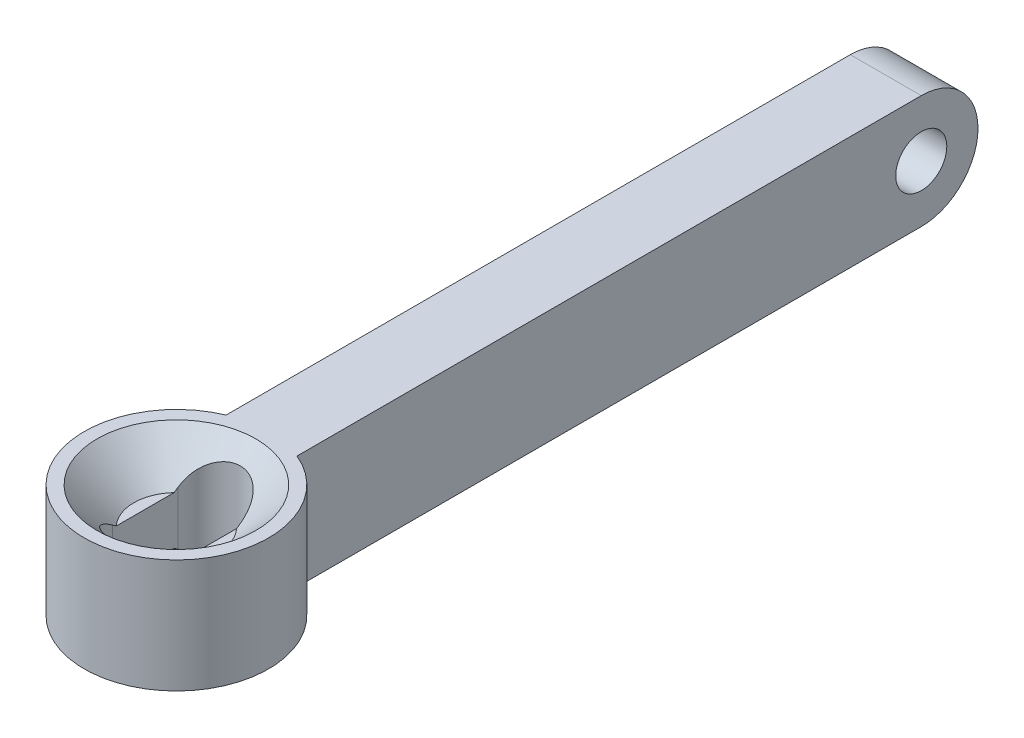
ISO-10303-21;
HEADER;
FILE_DESCRIPTION(('STEP AP214'),'2;1');
FILE_NAME('part.step','',(''),(''),'','','');
FILE_SCHEMA(('AUTOMOTIVE_DESIGN { 1 0 10303 214 1 1 1 1 }'));
ENDSEC;
DATA;
#1=APPLICATION_CONTEXT('core data for automotive mechanical design processes');
#2=APPLICATION_PROTOCOL_DEFINITION('international standard','automotive_design',2000,#1);
#3=PRODUCT_CONTEXT('',#1,'mechanical');
#4=PRODUCT('Part','Part','',(#3));
#5=PRODUCT_RELATED_PRODUCT_CATEGORY('part','',(#4));
#6=PRODUCT_DEFINITION_FORMATION('','',#4);
#7=PRODUCT_DEFINITION_CONTEXT('part definition',#1,'design');
#8=PRODUCT_DEFINITION('design','',#6,#7);
#9=PRODUCT_DEFINITION_SHAPE('','',#8);
#10=(LENGTH_UNIT() NAMED_UNIT(*) SI_UNIT(.MILLI.,.METRE.));
#11=(NAMED_UNIT(*) PLANE_ANGLE_UNIT() SI_UNIT($,.RADIAN.));
#12=(NAMED_UNIT(*) SI_UNIT($,.STERADIAN.) SOLID_ANGLE_UNIT());
#13=UNCERTAINTY_MEASURE_WITH_UNIT(LENGTH_MEASURE(1.E-05),#10,'distance_accuracy_value','');
#14=(GEOMETRIC_REPRESENTATION_CONTEXT(3) GLOBAL_UNCERTAINTY_ASSIGNED_CONTEXT((#13)) GLOBAL_UNIT_ASSIGNED_CONTEXT((#10,
#11,#12)) REPRESENTATION_CONTEXT('',''));
#15=CARTESIAN_POINT('',(0.,0.,0.));
#16=DIRECTION('',(0.,0.,1.));
#17=DIRECTION('',(1.,0.,0.));
#18=AXIS2_PLACEMENT_3D('',#15,#16,#17);
#19=CARTESIAN_POINT('',(0.,4.,0.));
#20=DIRECTION('',(0.,-1.,0.));
#21=DIRECTION('',(0.,0.,-1.));
#22=AXIS2_PLACEMENT_3D('',#19,#20,#21);
#23=CYLINDRICAL_SURFACE('',#22,3.25);
#24=DIRECTION('',(0.,-1.,0.));
#25=VECTOR('',#24,1.);
#26=CARTESIAN_POINT('',(1.25,4.,-3.));
#27=LINE('',#26,#25);
#28=CARTESIAN_POINT('',(1.25,4.,-3.));
#29=VERTEX_POINT('',#28);
#30=CARTESIAN_POINT('',(1.25,0.,-3.));
#31=VERTEX_POINT('',#30);
#32=EDGE_CURVE('E251',#29,#31,#27,.T.);
#33=ORIENTED_EDGE('',*,*,#32,.F.);
#34=CARTESIAN_POINT('',(0.,4.,0.));
#35=DIRECTION('',(0.,1.,0.));
#36=DIRECTION('',(0.,0.,1.));
#37=AXIS2_PLACEMENT_3D('',#34,#35,#36);
#38=CIRCLE('',#37,3.25);
#39=CARTESIAN_POINT('',(-1.25,4.,-3.));
#40=VERTEX_POINT('',#39);
#41=EDGE_CURVE('E216',#40,#29,#38,.T.);
#42=ORIENTED_EDGE('',*,*,#41,.F.);
#43=DIRECTION('',(0.,-1.,0.));
#44=VECTOR('',#43,1.);
#45=CARTESIAN_POINT('',(-1.25,4.,-3.));
#46=LINE('',#45,#44);
#47=CARTESIAN_POINT('',(-1.25,0.,-3.));
#48=VERTEX_POINT('',#47);
#49=EDGE_CURVE('E241',#40,#48,#46,.T.);
#50=ORIENTED_EDGE('',*,*,#49,.T.);
#51=CARTESIAN_POINT('',(0.,0.,0.));
#52=DIRECTION('',(0.,1.,0.));
#53=DIRECTION('',(0.,0.,1.));
#54=AXIS2_PLACEMENT_3D('',#51,#52,#53);
#55=CIRCLE('',#54,3.25);
#56=EDGE_CURVE('E217',#48,#31,#55,.T.);
#57=ORIENTED_EDGE('',*,*,#56,.T.);
#58=EDGE_LOOP('',(#33,#42,#50,#57));
#59=FACE_BOUND('',#58,.T.);
#60=ADVANCED_FACE('F34',(#59),#23,.T.);
#61=CARTESIAN_POINT('',(0.,4.,0.));
#62=DIRECTION('',(0.,1.,0.));
#63=DIRECTION('',(0.,0.,1.));
#64=AXIS2_PLACEMENT_3D('',#61,#62,#63);
#65=PLANE('',#64);
#66=CARTESIAN_POINT('',(0.,4.,0.));
#67=DIRECTION('',(0.,-1.,0.));
#68=DIRECTION('',(0.,0.,-1.));
#69=AXIS2_PLACEMENT_3D('',#66,#67,#68);
#70=CIRCLE('',#69,2.8);
#71=CARTESIAN_POINT('',(0.,4.,-2.8));
#72=VERTEX_POINT('',#71);
#73=EDGE_CURVE('E444',#72,#72,#70,.T.);
#74=ORIENTED_EDGE('',*,*,#73,.T.);
#75=EDGE_LOOP('',(#74));
#76=FACE_BOUND('',#75,.T.);
#77=DIRECTION('',(0.,0.,1.));
#78=VECTOR('',#77,1.);
#79=CARTESIAN_POINT('',(-1.25,4.,-3.));
#80=LINE('',#79,#78);
#81=CARTESIAN_POINT('',(-1.25,4.,-25.));
#82=VERTEX_POINT('',#81);
#83=EDGE_CURVE('E244',#82,#40,#80,.T.);
#84=ORIENTED_EDGE('',*,*,#83,.T.);
#85=ORIENTED_EDGE('',*,*,#41,.T.);
#86=DIRECTION('',(0.,0.,1.));
#87=VECTOR('',#86,1.);
#88=CARTESIAN_POINT('',(1.25,4.,-3.));
#89=LINE('',#88,#87);
#90=CARTESIAN_POINT('',(1.25,4.,-25.));
#91=VERTEX_POINT('',#90);
#92=EDGE_CURVE('E238',#91,#29,#89,.T.);
#93=ORIENTED_EDGE('',*,*,#92,.F.);
#94=DIRECTION('',(-1.,0.,0.));
#95=VECTOR('',#94,1.);
#96=CARTESIAN_POINT('',(1.25,4.,-25.));
#97=LINE('',#96,#95);
#98=EDGE_CURVE('E232',#91,#82,#97,.T.);
#99=ORIENTED_EDGE('',*,*,#98,.T.);
#100=EDGE_LOOP('',(#84,#85,#93,#99));
#101=FACE_BOUND('',#100,.T.);
#102=ADVANCED_FACE('F302',(#76,#101),#65,.T.);
#103=CARTESIAN_POINT('',(0.,0.,0.));
#104=DIRECTION('',(0.,1.,0.));
#105=DIRECTION('',(0.,0.,1.));
#106=AXIS2_PLACEMENT_3D('',#103,#104,#105);
#107=PLANE('',#106);
#108=CARTESIAN_POINT('',(0.,0.,0.));
#109=DIRECTION('',(0.,-1.,0.));
#110=DIRECTION('',(0.,0.,-1.));
#111=AXIS2_PLACEMENT_3D('',#108,#109,#110);
#112=CIRCLE('',#111,2.5);
#113=CARTESIAN_POINT('',(0.,0.,-2.5));
#114=VERTEX_POINT('',#113);
#115=EDGE_CURVE('E278',#114,#114,#112,.T.);
#116=ORIENTED_EDGE('',*,*,#115,.F.);
#117=EDGE_LOOP('',(#116));
#118=FACE_BOUND('',#117,.T.);
#119=DIRECTION('',(0.,0.,-1.));
#120=VECTOR('',#119,1.);
#121=CARTESIAN_POINT('',(1.25,0.,-3.));
#122=LINE('',#121,#120);
#123=CARTESIAN_POINT('',(1.25,0.,-25.));
#124=VERTEX_POINT('',#123);
#125=EDGE_CURVE('E249',#31,#124,#122,.T.);
#126=ORIENTED_EDGE('',*,*,#125,.F.);
#127=ORIENTED_EDGE('',*,*,#56,.F.);
#128=DIRECTION('',(0.,0.,-1.));
#129=VECTOR('',#128,1.);
#130=CARTESIAN_POINT('',(-1.25,0.,-3.));
#131=LINE('',#130,#129);
#132=CARTESIAN_POINT('',(-1.25,0.,-25.));
#133=VERTEX_POINT('',#132);
#134=EDGE_CURVE('E239',#48,#133,#131,.T.);
#135=ORIENTED_EDGE('',*,*,#134,.T.);
#136=DIRECTION('',(-1.,0.,0.));
#137=VECTOR('',#136,1.);
#138=CARTESIAN_POINT('',(1.25,0.,-25.));
#139=LINE('',#138,#137);
#140=EDGE_CURVE('E229',#124,#133,#139,.T.);
#141=ORIENTED_EDGE('',*,*,#140,.F.);
#142=EDGE_LOOP('',(#126,#127,#135,#141));
#143=FACE_BOUND('',#142,.T.);
#144=ADVANCED_FACE('F307',(#118,#143),#107,.F.);
#145=CARTESIAN_POINT('',(0.,4.,-1.15));
#146=DIRECTION('',(0.,-1.,0.));
#147=DIRECTION('',(0.,0.,-1.));
#148=AXIS2_PLACEMENT_3D('',#145,#146,#147);
#149=CYLINDRICAL_SURFACE('',#148,1.1);
#150=CARTESIAN_POINT('',(-1.09999998181818,2.79123851134895,-1.14980000000001));
#151=CARTESIAN_POINT('',(-1.10005734298542,2.83727686518787,-1.21346213388638));
#152=CARTESIAN_POINT('',(-1.09448993335906,2.88204477362716,-1.27821252134466));
#153=CARTESIAN_POINT('',(-1.07130834005445,2.96868210516723,-1.40820405365493));
#154=CARTESIAN_POINT('',(-1.05360205803646,3.01052665511345,-1.47344515228292));
#155=CARTESIAN_POINT('',(-1.00367490575828,3.09295101680243,-1.60606327114398));
#156=CARTESIAN_POINT('',(-0.970546108021612,3.13324972029756,-1.673282291868));
#157=CARTESIAN_POINT('',(-0.889508876860084,3.20809007706549,-1.80153496488029));
#158=CARTESIAN_POINT('',(-0.841647778345093,3.24264963048237,-1.86258760714681));
#159=CARTESIAN_POINT('',(-0.740110699274959,3.30028668920162,-1.96652128134119));
#160=CARTESIAN_POINT('',(-0.688356010463045,3.32430730431485,-2.01075445298934));
#161=CARTESIAN_POINT('',(-0.575934503958903,3.36661395309502,-2.08968146982421));
#162=CARTESIAN_POINT('',(-0.515273138862211,3.38490347397279,-2.12438111430593));
#163=CARTESIAN_POINT('',(-0.396137155446366,3.41291844441406,-2.17797393873818));
#164=CARTESIAN_POINT('',(-0.338546501516047,3.42348465582886,-2.1984003820654));
#165=CARTESIAN_POINT('',(-0.220120765175336,3.43950391962496,-2.22948375420956));
#166=CARTESIAN_POINT('',(-0.159288217137464,3.44496090595843,-2.24014819933491));
#167=CARTESIAN_POINT('',(-0.0417383354777392,3.45033568719122,-2.25065425236976));
#168=CARTESIAN_POINT('',(0.0148852006261075,3.45068788383433,-2.25134460670275));
#169=CARTESIAN_POINT('',(0.127416256892867,3.44695679591624,-2.24404836402719));
#170=CARTESIAN_POINT('',(0.183323900720304,3.44287428816399,-2.23606328665832));
#171=CARTESIAN_POINT('',(0.29163293172623,3.4305304207785,-2.21205620184121));
#172=CARTESIAN_POINT('',(0.344083494771923,3.42235937421503,-2.19620794781885));
#173=CARTESIAN_POINT('',(0.445402400925939,3.40211028162123,-2.15725547301861));
#174=CARTESIAN_POINT('',(0.494270397282102,3.39003185801154,-2.13415055101751));
#175=CARTESIAN_POINT('',(0.589104887257088,3.36173694857321,-2.08060847219464));
#176=CARTESIAN_POINT('',(0.634890781406755,3.34538076622122,-2.04992624201778));
#177=CARTESIAN_POINT('',(0.720552036873369,3.30916004239254,-1.98292538693596));
#178=CARTESIAN_POINT('',(0.760425785146596,3.28929454667819,-1.94660522931621));
#179=CARTESIAN_POINT('',(0.836850653829629,3.24460602083899,-1.86624925605483));
#180=CARTESIAN_POINT('',(0.872822157076153,3.21950372486615,-1.82181866745331));
#181=CARTESIAN_POINT('',(0.936795330850573,3.16611056825914,-1.72929465724043));
#182=CARTESIAN_POINT('',(0.964792802681917,3.13781803872301,-1.68119932280169));
#183=CARTESIAN_POINT('',(1.01568051999774,3.07490090925283,-1.57680349908624));
#184=CARTESIAN_POINT('',(1.03754067877926,3.0399244560096,-1.52021498739221));
#185=CARTESIAN_POINT('',(1.0714548956806,2.96709110176296,-1.40599397798228));
#186=CARTESIAN_POINT('',(1.08351012366882,2.92923454498664,-1.34836160565294));
#187=CARTESIAN_POINT('',(1.09398995312022,2.87408062130512,-1.26729771220161));
#188=CARTESIAN_POINT('',(1.09626200795652,2.8577530680499,-1.24364002220049));
#189=CARTESIAN_POINT('',(1.09926692301662,2.82475596380492,-1.19654813954689));
#190=CARTESIAN_POINT('',(1.10000337668831,2.8080873036355,-1.17311355314291));
#191=CARTESIAN_POINT('',(1.09999998181818,2.79123851134894,-1.14980000000001));
#192=B_SPLINE_CURVE_WITH_KNOTS('',3,(#150,#151,#152,#153,#154,#155,#156,#157,#158,#159,#160,
#161,#162,#163,#164,#165,#166,#167,#168,#169,#170,#171,#172,#173,#174,#175,#176,#177,#178,#179,
#180,#181,#182,#183,#184,#185,#186,#187,#188,#189,#190,#191),.UNSPECIFIED.,.F.,.F.,(4,2,2,2,2,2,
2,2,2,2,2,2,2,2,2,2,2,2,2,2,4),(0.,0.235683672119941,0.473175572121485,0.726872050090997,
0.979761762146121,1.19506785561738,1.41024268580156,1.59527637913252,1.78016748454459,
1.94922258541233,2.11824807836695,2.28369463658227,2.44915718707958,2.62090173501097,
2.79269305508027,2.97924095599862,3.16588690218748,3.37515157013405,3.58439126615019,
3.67086105287462,3.75712826421191),.UNSPECIFIED.);
#193=CARTESIAN_POINT('',(-1.1,2.79138304628395,-1.15));
#194=VERTEX_POINT('',#193);
#195=CARTESIAN_POINT('',(1.1,2.79138304628395,-1.15));
#196=VERTEX_POINT('',#195);
#197=EDGE_CURVE('E124',#194,#196,#192,.T.);
#198=ORIENTED_EDGE('',*,*,#197,.F.);
#199=DIRECTION('',(0.,-1.,0.));
#200=VECTOR('',#199,1.);
#201=CARTESIAN_POINT('',(-1.1,4.,-1.15));
#202=LINE('',#201,#200);
#203=CARTESIAN_POINT('',(-1.1,0.908616953716048,-1.15));
#204=VERTEX_POINT('',#203);
#205=EDGE_CURVE('E219',#194,#204,#202,.T.);
#206=ORIENTED_EDGE('',*,*,#205,.T.);
#207=CARTESIAN_POINT('',(1.09999998181818,0.908761488651053,-1.14980000000001));
#208=CARTESIAN_POINT('',(1.10005734298542,0.862723134812124,-1.21346213388638));
#209=CARTESIAN_POINT('',(1.09448993335906,0.817955226372842,-1.27821252134466));
#210=CARTESIAN_POINT('',(1.07130834005445,0.731317894832765,-1.40820405365493));
#211=CARTESIAN_POINT('',(1.05360205803646,0.689473344886545,-1.47344515228292));
#212=CARTESIAN_POINT('',(1.00367490575828,0.607048983197571,-1.60606327114398));
#213=CARTESIAN_POINT('',(0.970546108021611,0.566750279702436,-1.673282291868));
#214=CARTESIAN_POINT('',(0.889508876860083,0.491909922934511,-1.80153496488029));
#215=CARTESIAN_POINT('',(0.841647778345092,0.457350369517634,-1.86258760714681));
#216=CARTESIAN_POINT('',(0.740110699274958,0.399713310798384,-1.96652128134119));
#217=CARTESIAN_POINT('',(0.688356010463044,0.375692695685153,-2.01075445298934));
#218=CARTESIAN_POINT('',(0.575934503958903,0.333386046904978,-2.08968146982421));
#219=CARTESIAN_POINT('',(0.51527313886221,0.315096526027204,-2.12438111430593));
#220=CARTESIAN_POINT('',(0.396137155446365,0.287081555585936,-2.17797393873818));
#221=CARTESIAN_POINT('',(0.338546501516046,0.276515344171137,-2.1984003820654));
#222=CARTESIAN_POINT('',(0.220120765175335,0.260496080375044,-2.22948375420956));
#223=CARTESIAN_POINT('',(0.159288217137463,0.255039094041572,-2.24014819933491));
#224=CARTESIAN_POINT('',(0.0417383354777383,0.249664312808778,-2.25065425236976));
#225=CARTESIAN_POINT('',(-0.0148852006261084,0.249312116165667,-2.25134460670275));
#226=CARTESIAN_POINT('',(-0.127416256892868,0.253043204083761,-2.24404836402719));
#227=CARTESIAN_POINT('',(-0.183323900720305,0.257125711836014,-2.23606328665832));
#228=CARTESIAN_POINT('',(-0.291632931726231,0.269469579221497,-2.21205620184121));
#229=CARTESIAN_POINT('',(-0.344083494771925,0.277640625784969,-2.19620794781885));
#230=CARTESIAN_POINT('',(-0.44540240092594,0.297889718378769,-2.15725547301861));
#231=CARTESIAN_POINT('',(-0.494270397282103,0.309968141988461,-2.13415055101751));
#232=CARTESIAN_POINT('',(-0.589104887257089,0.338263051426792,-2.08060847219464));
#233=CARTESIAN_POINT('',(-0.634890781406757,0.354619233778779,-2.04992624201778));
#234=CARTESIAN_POINT('',(-0.72055203687337,0.390839957607457,-1.98292538693596));
#235=CARTESIAN_POINT('',(-0.760425785146597,0.410705453321812,-1.94660522931621));
#236=CARTESIAN_POINT('',(-0.83685065382963,0.455393979161011,-1.86624925605483));
#237=CARTESIAN_POINT('',(-0.872822157076154,0.48049627513385,-1.82181866745331));
#238=CARTESIAN_POINT('',(-0.936795330850574,0.533889431740863,-1.72929465724043));
#239=CARTESIAN_POINT('',(-0.964792802681918,0.562181961276985,-1.68119932280169));
#240=CARTESIAN_POINT('',(-1.01568051999774,0.625099090747166,-1.57680349908624));
#241=CARTESIAN_POINT('',(-1.03754067877926,0.660075543990395,-1.52021498739221));
#242=CARTESIAN_POINT('',(-1.0714548956806,0.732908898237041,-1.40599397798228));
#243=CARTESIAN_POINT('',(-1.08351012366882,0.770765455013362,-1.34836160565294));
#244=CARTESIAN_POINT('',(-1.09398995312022,0.825919378694878,-1.26729771220161));
#245=CARTESIAN_POINT('',(-1.09626200795652,0.842246931950097,-1.24364002220049));
#246=CARTESIAN_POINT('',(-1.09926692301662,0.875244036195079,-1.19654813954689));
#247=CARTESIAN_POINT('',(-1.10000337668832,0.891912696364494,-1.17311355314291));
#248=CARTESIAN_POINT('',(-1.09999998181818,0.908761488651052,-1.14980000000001));
#249=B_SPLINE_CURVE_WITH_KNOTS('',3,(#207,#208,#209,#210,#211,#212,#213,#214,#215,#216,#217,
#218,#219,#220,#221,#222,#223,#224,#225,#226,#227,#228,#229,#230,#231,#232,#233,#234,#235,#236,
#237,#238,#239,#240,#241,#242,#243,#244,#245,#246,#247,#248),.UNSPECIFIED.,.F.,.F.,(4,2,2,2,2,2,
2,2,2,2,2,2,2,2,2,2,2,2,2,2,4),(0.,0.235683672119941,0.473175572121484,0.726872050090997,
0.979761762146121,1.19506785561738,1.41024268580156,1.59527637913252,1.78016748454459,
1.94922258541233,2.11824807836695,2.28369463658227,2.44915718707958,2.62090173501097,
2.79269305508027,2.97924095599862,3.16588690218748,3.37515157013405,3.58439126615019,
3.67086105287462,3.75712826421191),.UNSPECIFIED.);
#250=CARTESIAN_POINT('',(1.1,0.908616953716048,-1.15));
#251=VERTEX_POINT('',#250);
#252=EDGE_CURVE('E192',#251,#204,#249,.T.);
#253=ORIENTED_EDGE('',*,*,#252,.F.);
#254=DIRECTION('',(0.,-1.,0.));
#255=VECTOR('',#254,1.);
#256=CARTESIAN_POINT('',(1.1,4.,-1.15));
#257=LINE('',#256,#255);
#258=EDGE_CURVE('E227',#196,#251,#257,.T.);
#259=ORIENTED_EDGE('',*,*,#258,.F.);
#260=EDGE_LOOP('',(#198,#206,#253,#259));
#261=FACE_BOUND('',#260,.T.);
#262=ADVANCED_FACE('F178',(#261),#149,.F.);
#263=CARTESIAN_POINT('',(-1.1,4.,-1.15));
#264=DIRECTION('',(1.,0.,0.));
#265=DIRECTION('',(0.,0.,-1.));
#266=AXIS2_PLACEMENT_3D('',#263,#264,#265);
#267=PLANE('',#266);
#268=CARTESIAN_POINT('',(-1.1,4.14827259274155,2.73538137763475));
#269=CARTESIAN_POINT('',(-1.1,4.0716987304082,2.65282369469881));
#270=CARTESIAN_POINT('',(-1.1,3.99535977476475,2.5700448233446));
#271=CARTESIAN_POINT('',(-1.1,3.84334978378572,2.40384316217279));
#272=CARTESIAN_POINT('',(-1.1,3.76767889901213,2.32042023476484));
#273=CARTESIAN_POINT('',(-1.1,3.61678103652053,2.15225690798743));
#274=CARTESIAN_POINT('',(-1.1,3.54155953043516,2.06751158773226));
#275=CARTESIAN_POINT('',(-1.1,3.39239154362782,1.89691931020546));
#276=CARTESIAN_POINT('',(-1.1,3.31844491240478,1.81107248508437));
#277=CARTESIAN_POINT('',(-1.1,3.1871389079424,1.65532461313932));
#278=CARTESIAN_POINT('',(-1.1,3.12944620377817,1.5857053803039));
#279=CARTESIAN_POINT('',(-1.1,3.01569361249054,1.44514800524554));
#280=CARTESIAN_POINT('',(-1.1,2.95963358736898,1.37420997532588));
#281=CARTESIAN_POINT('',(-1.1,2.84992003564901,1.23060400994485));
#282=CARTESIAN_POINT('',(-1.1,2.79626400217884,1.15793800349139));
#283=CARTESIAN_POINT('',(-1.1,2.69250847407567,1.01012920021532));
#284=CARTESIAN_POINT('',(-1.1,2.64240709887987,0.934987744290187));
#285=CARTESIAN_POINT('',(-1.1,2.54974723205385,0.784352546512437));
#286=CARTESIAN_POINT('',(-1.1,2.50696358774933,0.708999779199787));
#287=CARTESIAN_POINT('',(-1.1,2.42979640166252,0.553993196476297));
#288=CARTESIAN_POINT('',(-1.1,2.39540484009626,0.474343576905856));
#289=CARTESIAN_POINT('',(-1.1,2.34631529340789,0.328122846870461));
#290=CARTESIAN_POINT('',(-1.1,2.32895960189949,0.262480978435702));
#291=CARTESIAN_POINT('',(-1.1,2.3056573896797,0.129326903004181));
#292=CARTESIAN_POINT('',(-1.1,2.29966847827101,0.0618226015347261));
#293=CARTESIAN_POINT('',(-1.1,2.3003615743904,-0.0733239161148111));
#294=CARTESIAN_POINT('',(-1.1,2.30708259699507,-0.140965918188226));
#295=CARTESIAN_POINT('',(-1.1,2.33176246673506,-0.274278017831258));
#296=CARTESIAN_POINT('',(-1.1,2.34976068617452,-0.339940358398206));
#297=CARTESIAN_POINT('',(-1.1,2.39627158706687,-0.47486603830691));
#298=CARTESIAN_POINT('',(-1.1,2.42567166456206,-0.543810407083914));
#299=CARTESIAN_POINT('',(-1.1,2.49109851461019,-0.678536579882258));
#300=CARTESIAN_POINT('',(-1.1,2.5271385586755,-0.744311711266245));
#301=CARTESIAN_POINT('',(-1.1,2.604016532965,-0.874085164357024));
#302=CARTESIAN_POINT('',(-1.1,2.64490976893951,-0.93805014677361));
#303=CARTESIAN_POINT('',(-1.1,2.72961936441767,-1.06390479271224));
#304=CARTESIAN_POINT('',(-1.1,2.77343304691761,-1.12579628075644));
#305=CARTESIAN_POINT('',(-1.1,2.87011740401327,-1.25761766883687));
#306=CARTESIAN_POINT('',(-1.1,2.92333354196093,-1.32729249522001));
#307=CARTESIAN_POINT('',(-1.1,3.03164352795977,-1.46517271832197));
#308=CARTESIAN_POINT('',(-1.1,3.08673765488841,-1.53337789432473));
#309=CARTESIAN_POINT('',(-1.1,3.1983127194843,-1.66874896303959));
#310=CARTESIAN_POINT('',(-1.1,3.25479492126593,-1.73591381018886));
#311=CARTESIAN_POINT('',(-1.1,3.36874654476271,-1.86940205880185));
#312=CARTESIAN_POINT('',(-1.1,3.42621600043218,-1.93572543118804));
#313=CARTESIAN_POINT('',(-1.1,3.59288031969022,-2.12590767788013));
#314=CARTESIAN_POINT('',(-1.1,3.70301217818334,-2.24894473281726));
#315=CARTESIAN_POINT('',(-1.1,3.86931674473727,-2.43226093130263));
#316=CARTESIAN_POINT('',(-1.1,3.92487890388959,-2.49309842372966));
#317=CARTESIAN_POINT('',(-1.1,4.0363394755683,-2.61445968797421));
#318=CARTESIAN_POINT('',(-1.1,4.09223787292103,-2.67498347372249));
#319=CARTESIAN_POINT('',(-1.1,4.14827259274155,-2.73538137763475));
#320=B_SPLINE_CURVE_WITH_KNOTS('',3,(#268,#269,#270,#271,#272,#273,#274,#275,#276,#277,#278,
#279,#280,#281,#282,#283,#284,#285,#286,#287,#288,#289,#290,#291,#292,#293,#294,#295,#296,#297,
#298,#299,#300,#301,#302,#303,#304,#305,#306,#307,#308,#309,#310,#311,#312,#313,#314,#315,#316,
#317,#318,#319),.UNSPECIFIED.,.F.,.F.,(4,2,2,2,2,2,2,2,2,2,2,2,2,2,2,2,2,2,2,2,2,2,2,2,2,4),(0.,
0.337810797559631,0.675695877233268,1.0156291979445,1.35552211032705,1.62675724666943,
1.89796939060593,2.16889179994546,2.43966979442631,2.69933683128394,2.95875474028496,
3.1616784491808,3.36384388612662,3.5666309081644,3.77012990008906,3.99445050763644,
4.21922443419806,4.44686373353916,4.67429716481536,4.93726813354558,5.20027832451162,
5.4635376299139,5.72680600770931,6.22216009546388,6.46933408492065,6.71649700244117),.UNSPECIFIED.);
#321=CARTESIAN_POINT('',(-1.1,2.79138304628395,1.15));
#322=VERTEX_POINT('',#321);
#323=CARTESIAN_POINT('',(-1.1,2.69999999999999,1.01980390271856));
#324=VERTEX_POINT('',#323);
#325=EDGE_CURVE('E163',#322,#324,#320,.T.);
#326=ORIENTED_EDGE('',*,*,#325,.F.);
#327=DIRECTION('',(0.,-1.,0.));
#328=VECTOR('',#327,1.);
#329=CARTESIAN_POINT('',(-1.1,4.,1.15));
#330=LINE('',#329,#328);
#331=CARTESIAN_POINT('',(-1.1,0.908616953716048,1.15));
#332=VERTEX_POINT('',#331);
#333=EDGE_CURVE('E223',#322,#332,#330,.T.);
#334=ORIENTED_EDGE('',*,*,#333,.T.);
#335=CARTESIAN_POINT('',(-1.1,-0.373844872159509,-2.65499234447813));
#336=CARTESIAN_POINT('',(-1.1,-0.300573328970005,-2.57565766040961));
#337=CARTESIAN_POINT('',(-1.1,-0.227537729928543,-2.49610172244244));
#338=CARTESIAN_POINT('',(-1.1,-0.0821329576414764,-2.33635136463747));
#339=CARTESIAN_POINT('',(-1.1,-0.00976393600205381,-2.25615680692561));
#340=CARTESIAN_POINT('',(-1.1,0.13450740686511,-2.09448983484837));
#341=CARTESIAN_POINT('',(-1.1,0.206404406554211,-2.01301266057347));
#342=CARTESIAN_POINT('',(-1.1,0.348939845872555,-1.84897707488303));
#343=CARTESIAN_POINT('',(-1.1,0.419578432116305,-1.76641879139524));
#344=CARTESIAN_POINT('',(-1.1,0.545465050938376,-1.61602921513477));
#345=CARTESIAN_POINT('',(-1.1,0.601029511115495,-1.54846356699799));
#346=CARTESIAN_POINT('',(-1.1,0.710536986478492,-1.41203330057014));
#347=CARTESIAN_POINT('',(-1.1,0.76448014009484,-1.34316879400006));
#348=CARTESIAN_POINT('',(-1.1,0.869998698974348,-1.20373769746665));
#349=CARTESIAN_POINT('',(-1.1,0.92157628202369,-1.13317276812201));
#350=CARTESIAN_POINT('',(-1.1,1.02124486919323,-0.989641991736107));
#351=CARTESIAN_POINT('',(-1.1,1.06933767610185,-0.916677414929784));
#352=CARTESIAN_POINT('',(-1.1,1.15942122062728,-0.768486587432576));
#353=CARTESIAN_POINT('',(-1.1,1.20149174944419,-0.693309805685725));
#354=CARTESIAN_POINT('',(-1.1,1.2770442724807,-0.53867257851937));
#355=CARTESIAN_POINT('',(-1.1,1.31053658764174,-0.459217421353261));
#356=CARTESIAN_POINT('',(-1.1,1.35779063513898,-0.313448626472203));
#357=CARTESIAN_POINT('',(-1.1,1.3742659387683,-0.248063041465158));
#358=CARTESIAN_POINT('',(-1.1,1.39047715116036,-0.148709901120175));
#359=CARTESIAN_POINT('',(-1.1,1.39446423506883,-0.115422173749251));
#360=CARTESIAN_POINT('',(-1.1,1.39942857228191,-0.0486172904437803));
#361=CARTESIAN_POINT('',(-1.1,1.40040597620982,-0.0151001460748427));
#362=CARTESIAN_POINT('',(-1.1,1.39928547431632,0.051947377937465));
#363=CARTESIAN_POINT('',(-1.1,1.39718155245439,0.0854776553495899));
#364=CARTESIAN_POINT('',(-1.1,1.39001405495729,0.152226535655582));
#365=CARTESIAN_POINT('',(-1.1,1.38494918609994,0.185444995915014));
#366=CARTESIAN_POINT('',(-1.1,1.36565620886189,0.284467093540317));
#367=CARTESIAN_POINT('',(-1.1,1.34733421106003,0.349483448976039));
#368=CARTESIAN_POINT('',(-1.1,1.2996082086209,0.485356986017132));
#369=CARTESIAN_POINT('',(-1.1,1.26902076740353,0.555775889584228));
#370=CARTESIAN_POINT('',(-1.1,1.20109421172964,0.693351088862152));
#371=CARTESIAN_POINT('',(-1.1,1.16374102309195,0.760500206129757));
#372=CARTESIAN_POINT('',(-1.1,1.08418914523189,0.89294731259127));
#373=CARTESIAN_POINT('',(-1.1,1.04193624594087,0.958212140117718));
#374=CARTESIAN_POINT('',(-1.1,0.954500005340444,1.08663387072946));
#375=CARTESIAN_POINT('',(-1.1,0.90931944815215,1.1497926924313));
#376=CARTESIAN_POINT('',(-1.1,0.814696379614488,1.27756724583477));
#377=CARTESIAN_POINT('',(-1.1,0.765153380727519,1.3421080403628));
#378=CARTESIAN_POINT('',(-1.1,0.664470033078062,1.46993551665646));
#379=CARTESIAN_POINT('',(-1.1,0.613329508899633,1.53322205944335));
#380=CARTESIAN_POINT('',(-1.1,0.458107404478042,1.7217644915201));
#381=CARTESIAN_POINT('',(-1.1,0.352304618541031,1.84559932756755));
#382=CARTESIAN_POINT('',(-1.1,0.143762272209414,2.08446811318322));
#383=CARTESIAN_POINT('',(-1.1,0.0411571840749041,2.19962085748231));
#384=CARTESIAN_POINT('',(-1.1,-0.113815440051808,2.37120807945889));
#385=CARTESIAN_POINT('',(-1.1,-0.165605484824623,2.4281650113468));
#386=CARTESIAN_POINT('',(-1.1,-0.269502787228315,2.54178488071994));
#387=CARTESIAN_POINT('',(-1.1,-0.321610032518706,2.59844782948554));
#388=CARTESIAN_POINT('',(-1.1,-0.373844872159509,2.65499234447813));
#389=B_SPLINE_CURVE_WITH_KNOTS('',3,(#335,#336,#337,#338,#339,#340,#341,#342,#343,#344,#345,
#346,#347,#348,#349,#350,#351,#352,#353,#354,#355,#356,#357,#358,#359,#360,#361,#362,#363,#364,
#365,#366,#367,#368,#369,#370,#371,#372,#373,#374,#375,#376,#377,#378,#379,#380,#381,#382,#383,
#384,#385,#386,#387,#388),.UNSPECIFIED.,.F.,.F.,(4,2,2,2,2,2,2,2,2,2,2,2,2,2,2,2,2,2,2,2,2,2,2,
2,2,2,4),(0.,0.323985355452405,0.648042663547214,0.974023869885408,1.29996684527955,
1.56238586269114,1.82478241021019,2.08693233196262,2.34894565214134,2.60708034501468,
2.86490298659915,3.06631849923227,3.16677516515582,3.26722680351506,3.36787482725126,
3.46856684285998,3.67040691664665,3.90020304280569,4.13048280108013,4.36361035044209,
4.59651936632209,4.84057513247189,5.08465779197289,5.57321488220966,6.03590104328108,
6.26684724144117,6.49778451148571),.UNSPECIFIED.);
#390=CARTESIAN_POINT('',(-1.1,1.,1.01980390271856));
#391=VERTEX_POINT('',#390);
#392=EDGE_CURVE('E193',#391,#332,#389,.T.);
#393=ORIENTED_EDGE('',*,*,#392,.F.);
#394=DIRECTION('',(0.,0.,1.));
#395=VECTOR('',#394,1.);
#396=CARTESIAN_POINT('',(-1.1,1.,-1.15));
#397=LINE('',#396,#395);
#398=CARTESIAN_POINT('',(-1.1,1.,-1.01980390271856));
#399=VERTEX_POINT('',#398);
#400=EDGE_CURVE('E259',#399,#391,#397,.T.);
#401=ORIENTED_EDGE('',*,*,#400,.F.);
#402=EDGE_CURVE('E185',#204,#399,#389,.T.);
#403=ORIENTED_EDGE('',*,*,#402,.F.);
#404=ORIENTED_EDGE('',*,*,#205,.F.);
#405=CARTESIAN_POINT('',(-1.1,2.69999999999999,-1.01980390271856));
#406=VERTEX_POINT('',#405);
#407=EDGE_CURVE('E168',#406,#194,#320,.T.);
#408=ORIENTED_EDGE('',*,*,#407,.F.);
#409=DIRECTION('',(0.,0.,-1.));
#410=VECTOR('',#409,1.);
#411=CARTESIAN_POINT('',(-1.1,2.69999999999999,-1.15));
#412=LINE('',#411,#410);
#413=EDGE_CURVE('E281',#324,#406,#412,.T.);
#414=ORIENTED_EDGE('',*,*,#413,.F.);
#415=EDGE_LOOP('',(#326,#334,#393,#401,#403,#404,#408,#414));
#416=FACE_BOUND('',#415,.T.);
#417=ADVANCED_FACE('F174',(#416),#267,.T.);
#418=CARTESIAN_POINT('',(0.,4.,1.15));
#419=DIRECTION('',(0.,-1.,0.));
#420=DIRECTION('',(0.,0.,-1.));
#421=AXIS2_PLACEMENT_3D('',#418,#419,#420);
#422=CYLINDRICAL_SURFACE('',#421,1.1);
#423=CARTESIAN_POINT('',(1.09999998181818,2.79123851134895,1.14980000000001));
#424=CARTESIAN_POINT('',(1.10005734298542,2.83727686518788,1.21346213388638));
#425=CARTESIAN_POINT('',(1.09448993335906,2.88204477362716,1.27821252134466));
#426=CARTESIAN_POINT('',(1.07130834005445,2.96868210516723,1.40820405365493));
#427=CARTESIAN_POINT('',(1.05360205803646,3.01052665511345,1.47344515228293));
#428=CARTESIAN_POINT('',(1.00367490575828,3.09295101680243,1.60606327114398));
#429=CARTESIAN_POINT('',(0.970546108021611,3.13324972029756,1.673282291868));
#430=CARTESIAN_POINT('',(0.889508876860083,3.20809007706549,1.80153496488029));
#431=CARTESIAN_POINT('',(0.841647778345092,3.24264963048237,1.86258760714681));
#432=CARTESIAN_POINT('',(0.740110699274958,3.30028668920162,1.96652128134119));
#433=CARTESIAN_POINT('',(0.688356010463044,3.32430730431485,2.01075445298934));
#434=CARTESIAN_POINT('',(0.575934503958903,3.36661395309502,2.08968146982421));
#435=CARTESIAN_POINT('',(0.51527313886221,3.38490347397279,2.12438111430593));
#436=CARTESIAN_POINT('',(0.396137155446365,3.41291844441406,2.17797393873818));
#437=CARTESIAN_POINT('',(0.338546501516046,3.42348465582886,2.1984003820654));
#438=CARTESIAN_POINT('',(0.220120765175335,3.43950391962495,2.22948375420956));
#439=CARTESIAN_POINT('',(0.159288217137463,3.44496090595843,2.24014819933491));
#440=CARTESIAN_POINT('',(0.0417383354777382,3.45033568719122,2.25065425236976));
#441=CARTESIAN_POINT('',(-0.0148852006261084,3.45068788383433,2.25134460670275));
#442=CARTESIAN_POINT('',(-0.127416256892868,3.44695679591624,2.24404836402719));
#443=CARTESIAN_POINT('',(-0.183323900720305,3.44287428816399,2.23606328665832));
#444=CARTESIAN_POINT('',(-0.291632931726231,3.4305304207785,2.21205620184121));
#445=CARTESIAN_POINT('',(-0.344083494771924,3.42235937421503,2.19620794781885));
#446=CARTESIAN_POINT('',(-0.44540240092594,3.40211028162123,2.15725547301861));
#447=CARTESIAN_POINT('',(-0.494270397282103,3.39003185801154,2.13415055101751));
#448=CARTESIAN_POINT('',(-0.589104887257089,3.36173694857321,2.08060847219464));
#449=CARTESIAN_POINT('',(-0.634890781406756,3.34538076622122,2.04992624201778));
#450=CARTESIAN_POINT('',(-0.72055203687337,3.30916004239254,1.98292538693596));
#451=CARTESIAN_POINT('',(-0.760425785146597,3.28929454667819,1.94660522931621));
#452=CARTESIAN_POINT('',(-0.836850653829629,3.24460602083899,1.86624925605483));
#453=CARTESIAN_POINT('',(-0.872822157076154,3.21950372486615,1.82181866745331));
#454=CARTESIAN_POINT('',(-0.936795330850574,3.16611056825914,1.72929465724043));
#455=CARTESIAN_POINT('',(-0.964792802681917,3.13781803872301,1.68119932280169));
#456=CARTESIAN_POINT('',(-1.01568051999774,3.07490090925283,1.57680349908624));
#457=CARTESIAN_POINT('',(-1.03754067877926,3.0399244560096,1.52021498739221));
#458=CARTESIAN_POINT('',(-1.0714548956806,2.96709110176296,1.40599397798228));
#459=CARTESIAN_POINT('',(-1.08351012366882,2.92923454498664,1.34836160565294));
#460=CARTESIAN_POINT('',(-1.09398995312022,2.87408062130512,1.26729771220161));
#461=CARTESIAN_POINT('',(-1.09626200795652,2.8577530680499,1.24364002220049));
#462=CARTESIAN_POINT('',(-1.09926692301662,2.82475596380492,1.19654813954689));
#463=CARTESIAN_POINT('',(-1.10000337668831,2.8080873036355,1.17311355314291));
#464=CARTESIAN_POINT('',(-1.09999998181818,2.79123851134895,1.14980000000001));
#465=B_SPLINE_CURVE_WITH_KNOTS('',3,(#423,#424,#425,#426,#427,#428,#429,#430,#431,#432,#433,
#434,#435,#436,#437,#438,#439,#440,#441,#442,#443,#444,#445,#446,#447,#448,#449,#450,#451,#452,
#453,#454,#455,#456,#457,#458,#459,#460,#461,#462,#463,#464),.UNSPECIFIED.,.F.,.F.,(4,2,2,2,2,2,
2,2,2,2,2,2,2,2,2,2,2,2,2,2,4),(0.,0.235683672119941,0.473175572121485,0.726872050090998,
0.979761762146121,1.19506785561738,1.41024268580156,1.59527637913252,1.78016748454459,
1.94922258541233,2.11824807836695,2.28369463658227,2.44915718707958,2.62090173501098,
2.79269305508027,2.97924095599862,3.16588690218748,3.37515157013405,3.58439126615019,
3.67086105287462,3.75712826421191),.UNSPECIFIED.);
#466=CARTESIAN_POINT('',(1.1,2.79138304628395,1.15));
#467=VERTEX_POINT('',#466);
#468=EDGE_CURVE('E131',#467,#322,#465,.T.);
#469=ORIENTED_EDGE('',*,*,#468,.F.);
#470=DIRECTION('',(0.,-1.,0.));
#471=VECTOR('',#470,1.);
#472=CARTESIAN_POINT('',(1.1,4.,1.15));
#473=LINE('',#472,#471);
#474=CARTESIAN_POINT('',(1.1,0.908616953716048,1.15));
#475=VERTEX_POINT('',#474);
#476=EDGE_CURVE('E225',#467,#475,#473,.T.);
#477=ORIENTED_EDGE('',*,*,#476,.T.);
#478=CARTESIAN_POINT('',(-1.09999998181818,0.908761488651052,1.14980000000001));
#479=CARTESIAN_POINT('',(-1.10005734298542,0.862723134812123,1.21346213388639));
#480=CARTESIAN_POINT('',(-1.09448993335906,0.817955226372841,1.27821252134466));
#481=CARTESIAN_POINT('',(-1.07130834005445,0.731317894832764,1.40820405365493));
#482=CARTESIAN_POINT('',(-1.05360205803646,0.689473344886544,1.47344515228293));
#483=CARTESIAN_POINT('',(-1.00367490575828,0.60704898319757,1.60606327114398));
#484=CARTESIAN_POINT('',(-0.970546108021611,0.566750279702436,1.673282291868));
#485=CARTESIAN_POINT('',(-0.889508876860083,0.49190992293451,1.80153496488029));
#486=CARTESIAN_POINT('',(-0.841647778345092,0.457350369517633,1.86258760714681));
#487=CARTESIAN_POINT('',(-0.740110699274958,0.399713310798383,1.96652128134119));
#488=CARTESIAN_POINT('',(-0.688356010463043,0.375692695685152,2.01075445298934));
#489=CARTESIAN_POINT('',(-0.575934503958902,0.333386046904977,2.08968146982421));
#490=CARTESIAN_POINT('',(-0.51527313886221,0.315096526027204,2.12438111430593));
#491=CARTESIAN_POINT('',(-0.396137155446365,0.287081555585936,2.17797393873818));
#492=CARTESIAN_POINT('',(-0.338546501516046,0.276515344171136,2.1984003820654));
#493=CARTESIAN_POINT('',(-0.220120765175335,0.260496080375044,2.22948375420956));
#494=CARTESIAN_POINT('',(-0.159288217137463,0.255039094041572,2.24014819933491));
#495=CARTESIAN_POINT('',(-0.0417383354777378,0.249664312808778,2.25065425236976));
#496=CARTESIAN_POINT('',(0.0148852006261088,0.249312116165667,2.25134460670275));
#497=CARTESIAN_POINT('',(0.127416256892868,0.253043204083761,2.24404836402719));
#498=CARTESIAN_POINT('',(0.183323900720305,0.257125711836014,2.23606328665832));
#499=CARTESIAN_POINT('',(0.291632931726231,0.269469579221497,2.21205620184121));
#500=CARTESIAN_POINT('',(0.344083494771925,0.277640625784969,2.19620794781885));
#501=CARTESIAN_POINT('',(0.445402400925941,0.297889718378769,2.15725547301861));
#502=CARTESIAN_POINT('',(0.494270397282103,0.309968141988461,2.13415055101751));
#503=CARTESIAN_POINT('',(0.589104887257089,0.338263051426792,2.08060847219464));
#504=CARTESIAN_POINT('',(0.634890781406757,0.35461923377878,2.04992624201778));
#505=CARTESIAN_POINT('',(0.72055203687337,0.390839957607457,1.98292538693596));
#506=CARTESIAN_POINT('',(0.760425785146597,0.410705453321812,1.94660522931621));
#507=CARTESIAN_POINT('',(0.83685065382963,0.455393979161011,1.86624925605483));
#508=CARTESIAN_POINT('',(0.872822157076154,0.48049627513385,1.82181866745331));
#509=CARTESIAN_POINT('',(0.936795330850574,0.533889431740863,1.72929465724043));
#510=CARTESIAN_POINT('',(0.964792802681918,0.562181961276985,1.68119932280169));
#511=CARTESIAN_POINT('',(1.01568051999774,0.625099090747166,1.57680349908624));
#512=CARTESIAN_POINT('',(1.03754067877926,0.660075543990395,1.52021498739221));
#513=CARTESIAN_POINT('',(1.0714548956806,0.732908898237041,1.40599397798228));
#514=CARTESIAN_POINT('',(1.08351012366882,0.770765455013362,1.34836160565294));
#515=CARTESIAN_POINT('',(1.09398995312022,0.825919378694878,1.26729771220161));
#516=CARTESIAN_POINT('',(1.09626200795652,0.842246931950096,1.24364002220049));
#517=CARTESIAN_POINT('',(1.09926692301662,0.875244036195078,1.19654813954689));
#518=CARTESIAN_POINT('',(1.10000337668832,0.891912696364494,1.17311355314291));
#519=CARTESIAN_POINT('',(1.09999998181818,0.908761488651052,1.14980000000001));
#520=B_SPLINE_CURVE_WITH_KNOTS('',3,(#478,#479,#480,#481,#482,#483,#484,#485,#486,#487,#488,
#489,#490,#491,#492,#493,#494,#495,#496,#497,#498,#499,#500,#501,#502,#503,#504,#505,#506,#507,
#508,#509,#510,#511,#512,#513,#514,#515,#516,#517,#518,#519),.UNSPECIFIED.,.F.,.F.,(4,2,2,2,2,2,
2,2,2,2,2,2,2,2,2,2,2,2,2,2,4),(0.,0.235683672119941,0.473175572121485,0.726872050090997,
0.979761762146121,1.19506785561738,1.41024268580156,1.59527637913252,1.78016748454458,
1.94922258541233,2.11824807836695,2.28369463658227,2.44915718707958,2.62090173501097,
2.79269305508027,2.97924095599862,3.16588690218748,3.37515157013405,3.58439126615019,
3.67086105287462,3.7571282642119),.UNSPECIFIED.);
#521=EDGE_CURVE('E191',#332,#475,#520,.T.);
#522=ORIENTED_EDGE('',*,*,#521,.F.);
#523=ORIENTED_EDGE('',*,*,#333,.F.);
#524=EDGE_LOOP('',(#469,#477,#522,#523));
#525=FACE_BOUND('',#524,.T.);
#526=ADVANCED_FACE('F177',(#525),#422,.F.);
#527=CARTESIAN_POINT('',(1.1,4.,-1.15));
#528=DIRECTION('',(-1.,0.,0.));
#529=DIRECTION('',(0.,0.,1.));
#530=AXIS2_PLACEMENT_3D('',#527,#528,#529);
#531=PLANE('',#530);
#532=CARTESIAN_POINT('',(1.1,4.14827259274155,-2.73538137763475));
#533=CARTESIAN_POINT('',(1.1,4.0716987304082,-2.65282369469881));
#534=CARTESIAN_POINT('',(1.1,3.99535977476475,-2.5700448233446));
#535=CARTESIAN_POINT('',(1.1,3.84334978378572,-2.40384316217279));
#536=CARTESIAN_POINT('',(1.1,3.76767889901213,-2.32042023476484));
#537=CARTESIAN_POINT('',(1.1,3.61678103652053,-2.15225690798743));
#538=CARTESIAN_POINT('',(1.1,3.54155953043516,-2.06751158773226));
#539=CARTESIAN_POINT('',(1.1,3.39239154362782,-1.89691931020546));
#540=CARTESIAN_POINT('',(1.1,3.31844491240478,-1.81107248508437));
#541=CARTESIAN_POINT('',(1.1,3.1871389079424,-1.65532461313932));
#542=CARTESIAN_POINT('',(1.1,3.12944620377817,-1.5857053803039));
#543=CARTESIAN_POINT('',(1.1,3.01569361249054,-1.44514800524554));
#544=CARTESIAN_POINT('',(1.1,2.95963358736898,-1.37420997532588));
#545=CARTESIAN_POINT('',(1.1,2.84992003564901,-1.23060400994485));
#546=CARTESIAN_POINT('',(1.1,2.79626400217884,-1.15793800349139));
#547=CARTESIAN_POINT('',(1.1,2.69250847407566,-1.01012920021532));
#548=CARTESIAN_POINT('',(1.1,2.64240709887987,-0.934987744290187));
#549=CARTESIAN_POINT('',(1.1,2.54974723205385,-0.784352546512437));
#550=CARTESIAN_POINT('',(1.1,2.50696358774933,-0.708999779199787));
#551=CARTESIAN_POINT('',(1.1,2.42979640166252,-0.553993196476298));
#552=CARTESIAN_POINT('',(1.1,2.39540484009626,-0.474343576905857));
#553=CARTESIAN_POINT('',(1.1,2.34631529340789,-0.328122846870461));
#554=CARTESIAN_POINT('',(1.1,2.32895960189949,-0.262480978435702));
#555=CARTESIAN_POINT('',(1.1,2.3056573896797,-0.129326903004182));
#556=CARTESIAN_POINT('',(1.1,2.29966847827101,-0.0618226015347266));
#557=CARTESIAN_POINT('',(1.1,2.3003615743904,0.0733239161148105));
#558=CARTESIAN_POINT('',(1.1,2.30708259699507,0.140965918188225));
#559=CARTESIAN_POINT('',(1.1,2.33176246673506,0.274278017831258));
#560=CARTESIAN_POINT('',(1.1,2.34976068617452,0.339940358398206));
#561=CARTESIAN_POINT('',(1.1,2.39627158706687,0.47486603830691));
#562=CARTESIAN_POINT('',(1.1,2.42567166456206,0.543810407083913));
#563=CARTESIAN_POINT('',(1.1,2.49109851461019,0.678536579882257));
#564=CARTESIAN_POINT('',(1.1,2.5271385586755,0.744311711266243));
#565=CARTESIAN_POINT('',(1.1,2.604016532965,0.874085164357022));
#566=CARTESIAN_POINT('',(1.1,2.64490976893951,0.938050146773609));
#567=CARTESIAN_POINT('',(1.1,2.72961936441767,1.06390479271224));
#568=CARTESIAN_POINT('',(1.1,2.77343304691761,1.12579628075644));
#569=CARTESIAN_POINT('',(1.1,2.87011740401327,1.25761766883686));
#570=CARTESIAN_POINT('',(1.1,2.92333354196092,1.32729249522001));
#571=CARTESIAN_POINT('',(1.1,3.03164352795977,1.46517271832197));
#572=CARTESIAN_POINT('',(1.1,3.0867376548884,1.53337789432473));
#573=CARTESIAN_POINT('',(1.1,3.1983127194843,1.66874896303959));
#574=CARTESIAN_POINT('',(1.1,3.25479492126592,1.73591381018886));
#575=CARTESIAN_POINT('',(1.1,3.36874654476271,1.86940205880184));
#576=CARTESIAN_POINT('',(1.1,3.42621600043218,1.93572543118804));
#577=CARTESIAN_POINT('',(1.1,3.59288031969022,2.12590767788013));
#578=CARTESIAN_POINT('',(1.1,3.70301217818334,2.24894473281726));
#579=CARTESIAN_POINT('',(1.1,3.86931674473727,2.43226093130263));
#580=CARTESIAN_POINT('',(1.1,3.92487890388959,2.49309842372966));
#581=CARTESIAN_POINT('',(1.1,4.0363394755683,2.61445968797421));
#582=CARTESIAN_POINT('',(1.1,4.09223787292103,2.6749834737225));
#583=CARTESIAN_POINT('',(1.1,4.14827259274155,2.73538137763475));
#584=B_SPLINE_CURVE_WITH_KNOTS('',3,(#532,#533,#534,#535,#536,#537,#538,#539,#540,#541,#542,
#543,#544,#545,#546,#547,#548,#549,#550,#551,#552,#553,#554,#555,#556,#557,#558,#559,#560,#561,
#562,#563,#564,#565,#566,#567,#568,#569,#570,#571,#572,#573,#574,#575,#576,#577,#578,#579,#580,
#581,#582,#583),.UNSPECIFIED.,.F.,.F.,(4,2,2,2,2,2,2,2,2,2,2,2,2,2,2,2,2,2,2,2,2,2,2,2,2,4),(0.,
0.337810797559631,0.675695877233269,1.01562919794451,1.35552211032705,1.62675724666943,
1.89796939060593,2.16889179994546,2.43966979442631,2.69933683128394,2.95875474028496,
3.16167844918081,3.36384388612662,3.5666309081644,3.77012990008906,3.99445050763644,
4.21922443419806,4.44686373353916,4.67429716481536,4.93726813354558,5.20027832451163,
5.4635376299139,5.72680600770931,6.22216009546388,6.46933408492065,6.71649700244117),.UNSPECIFIED.);
#585=CARTESIAN_POINT('',(1.1,2.69999999999999,-1.01980390271856));
#586=VERTEX_POINT('',#585);
#587=EDGE_CURVE('E11',#196,#586,#584,.T.);
#588=ORIENTED_EDGE('',*,*,#587,.F.);
#589=ORIENTED_EDGE('',*,*,#258,.T.);
#590=CARTESIAN_POINT('',(1.1,-0.37384487215951,2.65499234447813));
#591=CARTESIAN_POINT('',(1.1,-0.300573328970006,2.57565766040961));
#592=CARTESIAN_POINT('',(1.1,-0.227537729928544,2.49610172244244));
#593=CARTESIAN_POINT('',(1.1,-0.0821329576414771,2.33635136463747));
#594=CARTESIAN_POINT('',(1.1,-0.00976393600205456,2.25615680692561));
#595=CARTESIAN_POINT('',(1.1,0.134507406865109,2.09448983484837));
#596=CARTESIAN_POINT('',(1.1,0.20640440655421,2.01301266057347));
#597=CARTESIAN_POINT('',(1.1,0.348939845872554,1.84897707488303));
#598=CARTESIAN_POINT('',(1.1,0.419578432116305,1.76641879139524));
#599=CARTESIAN_POINT('',(1.1,0.545465050938376,1.61602921513477));
#600=CARTESIAN_POINT('',(1.1,0.601029511115494,1.548463566998));
#601=CARTESIAN_POINT('',(1.1,0.71053698647849,1.41203330057014));
#602=CARTESIAN_POINT('',(1.1,0.764480140094839,1.34316879400006));
#603=CARTESIAN_POINT('',(1.1,0.869998698974347,1.20373769746665));
#604=CARTESIAN_POINT('',(1.1,0.921576282023689,1.13317276812201));
#605=CARTESIAN_POINT('',(1.1,1.02124486919323,0.989641991736109));
#606=CARTESIAN_POINT('',(1.1,1.06933767610185,0.916677414929786));
#607=CARTESIAN_POINT('',(1.1,1.15942122062728,0.768486587432578));
#608=CARTESIAN_POINT('',(1.1,1.20149174944419,0.693309805685727));
#609=CARTESIAN_POINT('',(1.1,1.2770442724807,0.538672578519372));
#610=CARTESIAN_POINT('',(1.1,1.31053658764174,0.459217421353262));
#611=CARTESIAN_POINT('',(1.1,1.35779063513898,0.313448626472205));
#612=CARTESIAN_POINT('',(1.1,1.3742659387683,0.248063041465159));
#613=CARTESIAN_POINT('',(1.1,1.39047715116036,0.148709901120176));
#614=CARTESIAN_POINT('',(1.1,1.39446423506883,0.115422173749253));
#615=CARTESIAN_POINT('',(1.1,1.39942857228191,0.0486172904437818));
#616=CARTESIAN_POINT('',(1.1,1.40040597620982,0.0151001460748443));
#617=CARTESIAN_POINT('',(1.1,1.39928547431632,-0.0519473779374634));
#618=CARTESIAN_POINT('',(1.1,1.39718155245439,-0.0854776553495883));
#619=CARTESIAN_POINT('',(1.1,1.39001405495729,-0.152226535655581));
#620=CARTESIAN_POINT('',(1.1,1.38494918609994,-0.185444995915013));
#621=CARTESIAN_POINT('',(1.1,1.36565620886189,-0.284467093540316));
#622=CARTESIAN_POINT('',(1.1,1.34733421106003,-0.349483448976038));
#623=CARTESIAN_POINT('',(1.1,1.2996082086209,-0.48535698601713));
#624=CARTESIAN_POINT('',(1.1,1.26902076740353,-0.555775889584227));
#625=CARTESIAN_POINT('',(1.1,1.20109421172964,-0.69335108886215));
#626=CARTESIAN_POINT('',(1.1,1.16374102309195,-0.760500206129755));
#627=CARTESIAN_POINT('',(1.1,1.0841891452319,-0.892947312591268));
#628=CARTESIAN_POINT('',(1.1,1.04193624594087,-0.958212140117716));
#629=CARTESIAN_POINT('',(1.1,0.954500005340446,-1.08663387072946));
#630=CARTESIAN_POINT('',(1.1,0.909319448152153,-1.14979269243129));
#631=CARTESIAN_POINT('',(1.1,0.814696379614491,-1.27756724583477));
#632=CARTESIAN_POINT('',(1.1,0.765153380727521,-1.3421080403628));
#633=CARTESIAN_POINT('',(1.1,0.664470033078064,-1.46993551665646));
#634=CARTESIAN_POINT('',(1.1,0.613329508899635,-1.53322205944335));
#635=CARTESIAN_POINT('',(1.1,0.458107404478043,-1.7217644915201));
#636=CARTESIAN_POINT('',(1.1,0.352304618541032,-1.84559932756755));
#637=CARTESIAN_POINT('',(1.1,0.143762272209414,-2.08446811318322));
#638=CARTESIAN_POINT('',(1.1,0.0411571840749042,-2.19962085748231));
#639=CARTESIAN_POINT('',(1.1,-0.113815440051808,-2.37120807945889));
#640=CARTESIAN_POINT('',(1.1,-0.165605484824624,-2.4281650113468));
#641=CARTESIAN_POINT('',(1.1,-0.269502787228316,-2.54178488071994));
#642=CARTESIAN_POINT('',(1.1,-0.321610032518707,-2.59844782948554));
#643=CARTESIAN_POINT('',(1.1,-0.37384487215951,-2.65499234447814));
#644=B_SPLINE_CURVE_WITH_KNOTS('',3,(#590,#591,#592,#593,#594,#595,#596,#597,#598,#599,#600,
#601,#602,#603,#604,#605,#606,#607,#608,#609,#610,#611,#612,#613,#614,#615,#616,#617,#618,#619,
#620,#621,#622,#623,#624,#625,#626,#627,#628,#629,#630,#631,#632,#633,#634,#635,#636,#637,#638,
#639,#640,#641,#642,#643),.UNSPECIFIED.,.F.,.F.,(4,2,2,2,2,2,2,2,2,2,2,2,2,2,2,2,2,2,2,2,2,2,2,
2,2,2,4),(0.,0.323985355452406,0.648042663547214,0.974023869885409,1.29996684527955,
1.56238586269114,1.82478241021019,2.08693233196262,2.34894565214134,2.60708034501468,
2.86490298659915,3.06631849923227,3.16677516515582,3.26722680351506,3.36787482725126,
3.46856684285998,3.67040691664665,3.90020304280569,4.13048280108013,4.36361035044209,
4.59651936632209,4.84057513247189,5.08465779197289,5.57321488220966,6.03590104328109,
6.26684724144118,6.49778451148572),.UNSPECIFIED.);
#645=CARTESIAN_POINT('',(1.1,0.999999999999658,-1.01980390271988));
#646=VERTEX_POINT('',#645);
#647=EDGE_CURVE('E140',#646,#251,#644,.T.);
#648=ORIENTED_EDGE('',*,*,#647,.F.);
#649=DIRECTION('',(0.,0.,-1.));
#650=VECTOR('',#649,1.);
#651=CARTESIAN_POINT('',(1.1,1.,-1.15));
#652=LINE('',#651,#650);
#653=CARTESIAN_POINT('',(1.1,1.,1.01980390271856));
#654=VERTEX_POINT('',#653);
#655=EDGE_CURVE('E138',#654,#646,#652,.T.);
#656=ORIENTED_EDGE('',*,*,#655,.F.);
#657=EDGE_CURVE('E136',#475,#654,#644,.T.);
#658=ORIENTED_EDGE('',*,*,#657,.F.);
#659=ORIENTED_EDGE('',*,*,#476,.F.);
#660=CARTESIAN_POINT('',(1.1,2.70000000000012,1.01980390271903));
#661=VERTEX_POINT('',#660);
#662=EDGE_CURVE('E42',#661,#467,#584,.T.);
#663=ORIENTED_EDGE('',*,*,#662,.F.);
#664=DIRECTION('',(0.,0.,1.));
#665=VECTOR('',#664,1.);
#666=CARTESIAN_POINT('',(1.1,2.69999999999999,-1.15));
#667=LINE('',#666,#665);
#668=EDGE_CURVE('E37',#586,#661,#667,.T.);
#669=ORIENTED_EDGE('',*,*,#668,.F.);
#670=EDGE_LOOP('',(#588,#589,#648,#656,#658,#659,#663,#669));
#671=FACE_BOUND('',#670,.T.);
#672=ADVANCED_FACE('F134',(#671),#531,.T.);
#673=CARTESIAN_POINT('',(1.25,2.,-25.));
#674=DIRECTION('',(1.,0.,0.));
#675=DIRECTION('',(0.,0.,-1.));
#676=AXIS2_PLACEMENT_3D('',#673,#674,#675);
#677=PLANE('',#676);
#678=ORIENTED_EDGE('',*,*,#92,.T.);
#679=ORIENTED_EDGE('',*,*,#32,.T.);
#680=ORIENTED_EDGE('',*,*,#125,.T.);
#681=CARTESIAN_POINT('',(1.25,2.,-25.));
#682=DIRECTION('',(1.,0.,0.));
#683=DIRECTION('',(0.,0.,-1.));
#684=AXIS2_PLACEMENT_3D('',#681,#682,#683);
#685=CIRCLE('',#684,2.);
#686=EDGE_CURVE('E235',#124,#91,#685,.T.);
#687=ORIENTED_EDGE('',*,*,#686,.T.);
#688=EDGE_LOOP('',(#678,#679,#680,#687));
#689=FACE_BOUND('',#688,.T.);
#690=CARTESIAN_POINT('',(1.25,2.,-25.));
#691=DIRECTION('',(1.,0.,0.));
#692=DIRECTION('',(0.,0.,-1.));
#693=AXIS2_PLACEMENT_3D('',#690,#691,#692);
#694=CIRCLE('',#693,0.9);
#695=CARTESIAN_POINT('',(1.25,2.,-25.9));
#696=VERTEX_POINT('',#695);
#697=EDGE_CURVE('E247',#696,#696,#694,.T.);
#698=ORIENTED_EDGE('',*,*,#697,.F.);
#699=EDGE_LOOP('',(#698));
#700=FACE_BOUND('',#699,.T.);
#701=ADVANCED_FACE('F315',(#689,#700),#677,.T.);
#702=CARTESIAN_POINT('',(-1.25,2.,-25.));
#703=DIRECTION('',(1.,0.,0.));
#704=DIRECTION('',(0.,0.,-1.));
#705=AXIS2_PLACEMENT_3D('',#702,#703,#704);
#706=PLANE('',#705);
#707=ORIENTED_EDGE('',*,*,#83,.F.);
#708=CARTESIAN_POINT('',(-1.25,2.,-25.));
#709=DIRECTION('',(1.,0.,0.));
#710=DIRECTION('',(0.,0.,-1.));
#711=AXIS2_PLACEMENT_3D('',#708,#709,#710);
#712=CIRCLE('',#711,2.);
#713=EDGE_CURVE('E236',#133,#82,#712,.T.);
#714=ORIENTED_EDGE('',*,*,#713,.F.);
#715=ORIENTED_EDGE('',*,*,#134,.F.);
#716=ORIENTED_EDGE('',*,*,#49,.F.);
#717=EDGE_LOOP('',(#707,#714,#715,#716));
#718=FACE_BOUND('',#717,.T.);
#719=CARTESIAN_POINT('',(-1.25,2.,-25.));
#720=DIRECTION('',(1.,0.,0.));
#721=DIRECTION('',(0.,0.,-1.));
#722=AXIS2_PLACEMENT_3D('',#719,#720,#721);
#723=CIRCLE('',#722,0.9);
#724=CARTESIAN_POINT('',(-1.25,2.,-25.9));
#725=VERTEX_POINT('',#724);
#726=EDGE_CURVE('E256',#725,#725,#723,.T.);
#727=ORIENTED_EDGE('',*,*,#726,.T.);
#728=EDGE_LOOP('',(#727));
#729=FACE_BOUND('',#728,.T.);
#730=ADVANCED_FACE('F323',(#718,#729),#706,.F.);
#731=CARTESIAN_POINT('',(1.25,2.,-25.));
#732=DIRECTION('',(-1.,0.,0.));
#733=DIRECTION('',(0.,0.,1.));
#734=AXIS2_PLACEMENT_3D('',#731,#732,#733);
#735=CYLINDRICAL_SURFACE('',#734,2.);
#736=ORIENTED_EDGE('',*,*,#713,.T.);
#737=ORIENTED_EDGE('',*,*,#98,.F.);
#738=ORIENTED_EDGE('',*,*,#686,.F.);
#739=ORIENTED_EDGE('',*,*,#140,.T.);
#740=EDGE_LOOP('',(#736,#737,#738,#739));
#741=FACE_BOUND('',#740,.T.);
#742=ADVANCED_FACE('F299',(#741),#735,.T.);
#743=CARTESIAN_POINT('',(1.25,2.,-25.));
#744=DIRECTION('',(-1.,0.,0.));
#745=DIRECTION('',(0.,0.,1.));
#746=AXIS2_PLACEMENT_3D('',#743,#744,#745);
#747=CYLINDRICAL_SURFACE('',#746,0.9);
#748=ORIENTED_EDGE('',*,*,#697,.T.);
#749=EDGE_LOOP('',(#748));
#750=FACE_BOUND('',#749,.T.);
#751=ORIENTED_EDGE('',*,*,#726,.F.);
#752=EDGE_LOOP('',(#751));
#753=FACE_BOUND('',#752,.T.);
#754=ADVANCED_FACE('F294',(#750,#753),#747,.F.);
#755=CARTESIAN_POINT('',(0.,1.,0.));
#756=DIRECTION('',(0.,1.,0.));
#757=DIRECTION('',(0.,0.,1.));
#758=AXIS2_PLACEMENT_3D('',#755,#756,#757);
#759=PLANE('',#758);
#760=ORIENTED_EDGE('',*,*,#400,.T.);
#761=CARTESIAN_POINT('',(0.,1.,0.));
#762=DIRECTION('',(0.,-1.,0.));
#763=DIRECTION('',(0.,0.,-1.));
#764=AXIS2_PLACEMENT_3D('',#761,#762,#763);
#765=CIRCLE('',#764,1.5);
#766=EDGE_CURVE('E276',#391,#399,#765,.T.);
#767=ORIENTED_EDGE('',*,*,#766,.T.);
#768=EDGE_LOOP('',(#760,#767));
#769=FACE_BOUND('',#768,.T.);
#770=ADVANCED_FACE('F292',(#769),#759,.F.);
#771=ORIENTED_EDGE('',*,*,#655,.T.);
#772=EDGE_CURVE('E56',#646,#654,#765,.T.);
#773=ORIENTED_EDGE('',*,*,#772,.T.);
#774=EDGE_LOOP('',(#771,#773));
#775=FACE_BOUND('',#774,.T.);
#776=ADVANCED_FACE('F207',(#775),#759,.F.);
#777=CARTESIAN_POINT('',(0.,0.,0.));
#778=DIRECTION('',(0.,-1.,0.));
#779=DIRECTION('',(0.,0.,-1.));
#780=AXIS2_PLACEMENT_3D('',#777,#778,#779);
#781=CONICAL_SURFACE('',#780,2.5,0.785398163397447);
#782=ORIENTED_EDGE('',*,*,#392,.T.);
#783=ORIENTED_EDGE('',*,*,#521,.T.);
#784=ORIENTED_EDGE('',*,*,#657,.T.);
#785=ORIENTED_EDGE('',*,*,#772,.F.);
#786=ORIENTED_EDGE('',*,*,#647,.T.);
#787=ORIENTED_EDGE('',*,*,#252,.T.);
#788=ORIENTED_EDGE('',*,*,#402,.T.);
#789=ORIENTED_EDGE('',*,*,#766,.F.);
#790=EDGE_LOOP('',(#782,#783,#784,#785,#786,#787,#788,#789));
#791=FACE_BOUND('',#790,.T.);
#792=ORIENTED_EDGE('',*,*,#115,.T.);
#793=EDGE_LOOP('',(#792));
#794=FACE_BOUND('',#793,.T.);
#795=ADVANCED_FACE('F202',(#791,#794),#781,.F.);
#796=CARTESIAN_POINT('',(0.,2.69999999999999,0.));
#797=DIRECTION('',(0.,-1.,0.));
#798=DIRECTION('',(0.,0.,-1.));
#799=AXIS2_PLACEMENT_3D('',#796,#797,#798);
#800=PLANE('',#799);
#801=ORIENTED_EDGE('',*,*,#413,.T.);
#802=CARTESIAN_POINT('',(0.,2.69999999999999,0.));
#803=DIRECTION('',(0.,-1.,0.));
#804=DIRECTION('',(0.,0.,-1.));
#805=AXIS2_PLACEMENT_3D('',#802,#803,#804);
#806=CIRCLE('',#805,1.5);
#807=EDGE_CURVE('E132',#324,#406,#806,.T.);
#808=ORIENTED_EDGE('',*,*,#807,.F.);
#809=EDGE_LOOP('',(#801,#808));
#810=FACE_BOUND('',#809,.T.);
#811=ADVANCED_FACE('F206',(#810),#800,.F.);
#812=ORIENTED_EDGE('',*,*,#668,.T.);
#813=EDGE_CURVE('E48',#586,#661,#806,.T.);
#814=ORIENTED_EDGE('',*,*,#813,.F.);
#815=EDGE_LOOP('',(#812,#814));
#816=FACE_BOUND('',#815,.T.);
#817=ADVANCED_FACE('F129',(#816),#800,.F.);
#818=CARTESIAN_POINT('',(0.,2.69999999999999,0.));
#819=DIRECTION('',(0.,1.,0.));
#820=DIRECTION('',(0.,0.,1.));
#821=AXIS2_PLACEMENT_3D('',#818,#819,#820);
#822=CONICAL_SURFACE('',#821,1.5,0.785398163397446);
#823=ORIENTED_EDGE('',*,*,#407,.T.);
#824=ORIENTED_EDGE('',*,*,#197,.T.);
#825=ORIENTED_EDGE('',*,*,#587,.T.);
#826=ORIENTED_EDGE('',*,*,#813,.T.);
#827=ORIENTED_EDGE('',*,*,#662,.T.);
#828=ORIENTED_EDGE('',*,*,#468,.T.);
#829=ORIENTED_EDGE('',*,*,#325,.T.);
#830=ORIENTED_EDGE('',*,*,#807,.T.);
#831=EDGE_LOOP('',(#823,#824,#825,#826,#827,#828,#829,#830));
#832=FACE_BOUND('',#831,.T.);
#833=ORIENTED_EDGE('',*,*,#73,.F.);
#834=EDGE_LOOP('',(#833));
#835=FACE_BOUND('',#834,.T.);
#836=ADVANCED_FACE('F121',(#832,#835),#822,.F.);
#837=CLOSED_SHELL('',(#60,#102,#144,#262,#417,#526,#672,#701,#730,#742,#754,#770,#776,#795,#811,
#817,#836));
#838=MANIFOLD_SOLID_BREP('B2',#837);
#839=ADVANCED_BREP_SHAPE_REPRESENTATION('',(#18,#838),#14);
#840=SHAPE_DEFINITION_REPRESENTATION(#9,#839);
ENDSEC;
END-ISO-10303-21;
